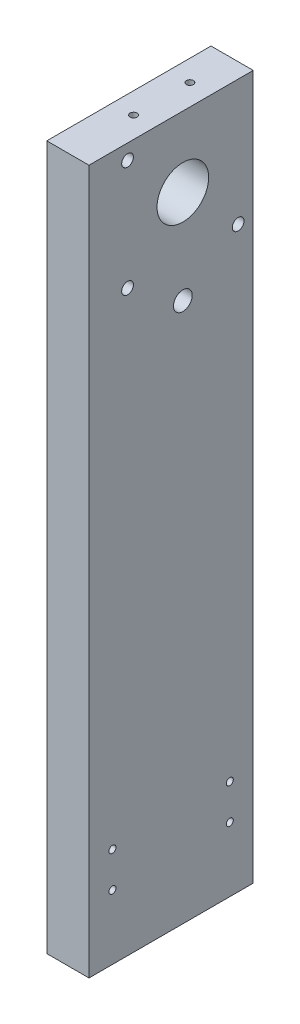
ISO-10303-21;
HEADER;
FILE_DESCRIPTION(('STEP AP214'),'2;1');
FILE_NAME('part.step','',(''),(''),'','','');
FILE_SCHEMA(('AUTOMOTIVE_DESIGN { 1 0 10303 214 1 1 1 1 }'));
ENDSEC;
DATA;
#1=APPLICATION_CONTEXT('core data for automotive mechanical design processes');
#2=APPLICATION_PROTOCOL_DEFINITION('international standard','automotive_design',2000,#1);
#3=PRODUCT_CONTEXT('',#1,'mechanical');
#4=PRODUCT('Part','Part','',(#3));
#5=PRODUCT_RELATED_PRODUCT_CATEGORY('part','',(#4));
#6=PRODUCT_DEFINITION_FORMATION('','',#4);
#7=PRODUCT_DEFINITION_CONTEXT('part definition',#1,'design');
#8=PRODUCT_DEFINITION('design','',#6,#7);
#9=PRODUCT_DEFINITION_SHAPE('','',#8);
#10=(LENGTH_UNIT() NAMED_UNIT(*) SI_UNIT(.MILLI.,.METRE.));
#11=(NAMED_UNIT(*) PLANE_ANGLE_UNIT() SI_UNIT($,.RADIAN.));
#12=(NAMED_UNIT(*) SI_UNIT($,.STERADIAN.) SOLID_ANGLE_UNIT());
#13=UNCERTAINTY_MEASURE_WITH_UNIT(LENGTH_MEASURE(1.E-05),#10,'distance_accuracy_value','');
#14=(GEOMETRIC_REPRESENTATION_CONTEXT(3) GLOBAL_UNCERTAINTY_ASSIGNED_CONTEXT((#13)) GLOBAL_UNIT_ASSIGNED_CONTEXT((#10,
#11,#12)) REPRESENTATION_CONTEXT('',''));
#15=CARTESIAN_POINT('',(0.,0.,0.));
#16=DIRECTION('',(0.,0.,1.));
#17=DIRECTION('',(1.,0.,0.));
#18=AXIS2_PLACEMENT_3D('',#15,#16,#17);
#19=CARTESIAN_POINT('',(18.,0.,0.));
#20=DIRECTION('',(1.,0.,0.));
#21=DIRECTION('',(0.,0.,-1.));
#22=AXIS2_PLACEMENT_3D('',#19,#20,#21);
#23=PLANE('',#22);
#24=CARTESIAN_POINT('',(18.,96.43,18.57));
#25=DIRECTION('',(1.,0.,0.));
#26=DIRECTION('',(0.,0.,-1.));
#27=AXIS2_PLACEMENT_3D('',#24,#25,#26);
#28=CIRCLE('',#27,2.5);
#29=CARTESIAN_POINT('',(18.,96.43,16.07));
#30=VERTEX_POINT('',#29);
#31=EDGE_CURVE('E150',#30,#30,#28,.T.);
#32=ORIENTED_EDGE('',*,*,#31,.F.);
#33=EDGE_LOOP('',(#32));
#34=FACE_BOUND('',#33,.T.);
#35=CARTESIAN_POINT('',(18.,96.43,-28.57));
#36=DIRECTION('',(1.,0.,0.));
#37=DIRECTION('',(0.,0.,-1.));
#38=AXIS2_PLACEMENT_3D('',#35,#36,#37);
#39=CIRCLE('',#38,2.5);
#40=CARTESIAN_POINT('',(18.,96.43,-31.07));
#41=VERTEX_POINT('',#40);
#42=EDGE_CURVE('E138',#41,#41,#39,.T.);
#43=ORIENTED_EDGE('',*,*,#42,.F.);
#44=EDGE_LOOP('',(#43));
#45=FACE_BOUND('',#44,.T.);
#46=CARTESIAN_POINT('',(18.,-107.5,25.));
#47=DIRECTION('',(1.,0.,0.));
#48=DIRECTION('',(0.,0.,-1.));
#49=AXIS2_PLACEMENT_3D('',#46,#47,#48);
#50=CIRCLE('',#49,1.5);
#51=CARTESIAN_POINT('',(18.,-107.5,23.5));
#52=VERTEX_POINT('',#51);
#53=EDGE_CURVE('E126',#52,#52,#50,.T.);
#54=ORIENTED_EDGE('',*,*,#53,.F.);
#55=EDGE_LOOP('',(#54));
#56=FACE_BOUND('',#55,.T.);
#57=CARTESIAN_POINT('',(18.,-122.5,25.));
#58=DIRECTION('',(1.,0.,0.));
#59=DIRECTION('',(0.,0.,-1.));
#60=AXIS2_PLACEMENT_3D('',#57,#58,#59);
#61=CIRCLE('',#60,1.5);
#62=CARTESIAN_POINT('',(18.,-122.5,23.5));
#63=VERTEX_POINT('',#62);
#64=EDGE_CURVE('E114',#63,#63,#61,.T.);
#65=ORIENTED_EDGE('',*,*,#64,.F.);
#66=EDGE_LOOP('',(#65));
#67=FACE_BOUND('',#66,.T.);
#68=DIRECTION('',(0.,1.,0.));
#69=VECTOR('',#68,1.);
#70=CARTESIAN_POINT('',(18.,-150.,-35.));
#71=LINE('',#70,#69);
#72=CARTESIAN_POINT('',(18.,-150.,-35.));
#73=VERTEX_POINT('',#72);
#74=CARTESIAN_POINT('',(18.,150.,-35.));
#75=VERTEX_POINT('',#74);
#76=EDGE_CURVE('E84',#73,#75,#71,.T.);
#77=ORIENTED_EDGE('',*,*,#76,.T.);
#78=DIRECTION('',(0.,0.,1.));
#79=VECTOR('',#78,1.);
#80=CARTESIAN_POINT('',(18.,150.,-35.));
#81=LINE('',#80,#79);
#82=CARTESIAN_POINT('',(18.,150.,35.));
#83=VERTEX_POINT('',#82);
#84=EDGE_CURVE('E79',#75,#83,#81,.T.);
#85=ORIENTED_EDGE('',*,*,#84,.T.);
#86=DIRECTION('',(0.,-1.,0.));
#87=VECTOR('',#86,1.);
#88=CARTESIAN_POINT('',(18.,-150.,35.));
#89=LINE('',#88,#87);
#90=CARTESIAN_POINT('',(18.,-150.,35.));
#91=VERTEX_POINT('',#90);
#92=EDGE_CURVE('E82',#83,#91,#89,.T.);
#93=ORIENTED_EDGE('',*,*,#92,.T.);
#94=DIRECTION('',(0.,0.,-1.));
#95=VECTOR('',#94,1.);
#96=CARTESIAN_POINT('',(18.,-150.,-35.));
#97=LINE('',#96,#95);
#98=EDGE_CURVE('E49',#91,#73,#97,.T.);
#99=ORIENTED_EDGE('',*,*,#98,.T.);
#100=EDGE_LOOP('',(#77,#85,#93,#99));
#101=FACE_BOUND('',#100,.T.);
#102=CARTESIAN_POINT('',(18.,-122.5,-25.));
#103=DIRECTION('',(1.,0.,0.));
#104=DIRECTION('',(0.,0.,-1.));
#105=AXIS2_PLACEMENT_3D('',#102,#103,#104);
#106=CIRCLE('',#105,1.5);
#107=CARTESIAN_POINT('',(18.,-122.5,-26.5));
#108=VERTEX_POINT('',#107);
#109=EDGE_CURVE('E99',#108,#108,#106,.T.);
#110=ORIENTED_EDGE('',*,*,#109,.F.);
#111=EDGE_LOOP('',(#110));
#112=FACE_BOUND('',#111,.T.);
#113=CARTESIAN_POINT('',(18.,-107.5,-25.));
#114=DIRECTION('',(1.,0.,0.));
#115=DIRECTION('',(0.,0.,-1.));
#116=AXIS2_PLACEMENT_3D('',#113,#114,#115);
#117=CIRCLE('',#116,1.5);
#118=CARTESIAN_POINT('',(18.,-107.5,-26.5));
#119=VERTEX_POINT('',#118);
#120=EDGE_CURVE('E120',#119,#119,#117,.T.);
#121=ORIENTED_EDGE('',*,*,#120,.F.);
#122=EDGE_LOOP('',(#121));
#123=FACE_BOUND('',#122,.T.);
#124=CARTESIAN_POINT('',(18.,80.,-5.));
#125=DIRECTION('',(1.,0.,0.));
#126=DIRECTION('',(0.,0.,-1.));
#127=AXIS2_PLACEMENT_3D('',#124,#125,#126);
#128=CIRCLE('',#127,4.);
#129=CARTESIAN_POINT('',(18.,80.,-9.00000000000001));
#130=VERTEX_POINT('',#129);
#131=EDGE_CURVE('E132',#130,#130,#128,.T.);
#132=ORIENTED_EDGE('',*,*,#131,.F.);
#133=EDGE_LOOP('',(#132));
#134=FACE_BOUND('',#133,.T.);
#135=CARTESIAN_POINT('',(18.,120.,-5.));
#136=DIRECTION('',(1.,0.,0.));
#137=DIRECTION('',(0.,0.,-1.));
#138=AXIS2_PLACEMENT_3D('',#135,#136,#137);
#139=CIRCLE('',#138,11.);
#140=CARTESIAN_POINT('',(18.,120.,-16.));
#141=VERTEX_POINT('',#140);
#142=EDGE_CURVE('E144',#141,#141,#139,.T.);
#143=ORIENTED_EDGE('',*,*,#142,.F.);
#144=EDGE_LOOP('',(#143));
#145=FACE_BOUND('',#144,.T.);
#146=CARTESIAN_POINT('',(18.,143.57,18.57));
#147=DIRECTION('',(1.,0.,0.));
#148=DIRECTION('',(0.,0.,-1.));
#149=AXIS2_PLACEMENT_3D('',#146,#147,#148);
#150=CIRCLE('',#149,2.5);
#151=CARTESIAN_POINT('',(18.,143.57,16.07));
#152=VERTEX_POINT('',#151);
#153=EDGE_CURVE('E156',#152,#152,#150,.T.);
#154=ORIENTED_EDGE('',*,*,#153,.F.);
#155=EDGE_LOOP('',(#154));
#156=FACE_BOUND('',#155,.T.);
#157=ADVANCED_FACE('F32',(#34,#45,#56,#67,#101,#112,#123,#134,#145,#156),#23,.T.);
#158=CARTESIAN_POINT('',(0.,0.,0.));
#159=DIRECTION('',(1.,0.,0.));
#160=DIRECTION('',(0.,0.,-1.));
#161=AXIS2_PLACEMENT_3D('',#158,#159,#160);
#162=PLANE('',#161);
#163=DIRECTION('',(0.,1.,0.));
#164=VECTOR('',#163,1.);
#165=CARTESIAN_POINT('',(0.,-150.,-35.));
#166=LINE('',#165,#164);
#167=CARTESIAN_POINT('',(0.,-150.,-35.));
#168=VERTEX_POINT('',#167);
#169=CARTESIAN_POINT('',(0.,150.,-35.));
#170=VERTEX_POINT('',#169);
#171=EDGE_CURVE('E96',#168,#170,#166,.T.);
#172=ORIENTED_EDGE('',*,*,#171,.F.);
#173=DIRECTION('',(0.,0.,-1.));
#174=VECTOR('',#173,1.);
#175=CARTESIAN_POINT('',(0.,-150.,-35.));
#176=LINE('',#175,#174);
#177=CARTESIAN_POINT('',(0.,-150.,35.));
#178=VERTEX_POINT('',#177);
#179=EDGE_CURVE('E72',#178,#168,#176,.T.);
#180=ORIENTED_EDGE('',*,*,#179,.F.);
#181=DIRECTION('',(0.,-1.,0.));
#182=VECTOR('',#181,1.);
#183=CARTESIAN_POINT('',(0.,-150.,35.));
#184=LINE('',#183,#182);
#185=CARTESIAN_POINT('',(0.,150.,35.));
#186=VERTEX_POINT('',#185);
#187=EDGE_CURVE('E66',#186,#178,#184,.T.);
#188=ORIENTED_EDGE('',*,*,#187,.F.);
#189=DIRECTION('',(0.,0.,1.));
#190=VECTOR('',#189,1.);
#191=CARTESIAN_POINT('',(0.,150.,-35.));
#192=LINE('',#191,#190);
#193=EDGE_CURVE('E88',#170,#186,#192,.T.);
#194=ORIENTED_EDGE('',*,*,#193,.F.);
#195=EDGE_LOOP('',(#172,#180,#188,#194));
#196=FACE_BOUND('',#195,.T.);
#197=CARTESIAN_POINT('',(0.,-122.5,-25.));
#198=DIRECTION('',(1.,0.,0.));
#199=DIRECTION('',(0.,0.,-1.));
#200=AXIS2_PLACEMENT_3D('',#197,#198,#199);
#201=CIRCLE('',#200,1.5);
#202=CARTESIAN_POINT('',(0.,-122.5,-26.5));
#203=VERTEX_POINT('',#202);
#204=EDGE_CURVE('E111',#203,#203,#201,.T.);
#205=ORIENTED_EDGE('',*,*,#204,.T.);
#206=EDGE_LOOP('',(#205));
#207=FACE_BOUND('',#206,.T.);
#208=CARTESIAN_POINT('',(0.,-122.5,25.));
#209=DIRECTION('',(1.,0.,0.));
#210=DIRECTION('',(0.,0.,-1.));
#211=AXIS2_PLACEMENT_3D('',#208,#209,#210);
#212=CIRCLE('',#211,1.5);
#213=CARTESIAN_POINT('',(0.,-122.5,23.5));
#214=VERTEX_POINT('',#213);
#215=EDGE_CURVE('E117',#214,#214,#212,.T.);
#216=ORIENTED_EDGE('',*,*,#215,.T.);
#217=EDGE_LOOP('',(#216));
#218=FACE_BOUND('',#217,.T.);
#219=CARTESIAN_POINT('',(0.,-107.5,-25.));
#220=DIRECTION('',(1.,0.,0.));
#221=DIRECTION('',(0.,0.,-1.));
#222=AXIS2_PLACEMENT_3D('',#219,#220,#221);
#223=CIRCLE('',#222,1.5);
#224=CARTESIAN_POINT('',(0.,-107.5,-26.5));
#225=VERTEX_POINT('',#224);
#226=EDGE_CURVE('E123',#225,#225,#223,.T.);
#227=ORIENTED_EDGE('',*,*,#226,.T.);
#228=EDGE_LOOP('',(#227));
#229=FACE_BOUND('',#228,.T.);
#230=CARTESIAN_POINT('',(0.,-107.5,25.));
#231=DIRECTION('',(1.,0.,0.));
#232=DIRECTION('',(0.,0.,-1.));
#233=AXIS2_PLACEMENT_3D('',#230,#231,#232);
#234=CIRCLE('',#233,1.5);
#235=CARTESIAN_POINT('',(0.,-107.5,23.5));
#236=VERTEX_POINT('',#235);
#237=EDGE_CURVE('E129',#236,#236,#234,.T.);
#238=ORIENTED_EDGE('',*,*,#237,.T.);
#239=EDGE_LOOP('',(#238));
#240=FACE_BOUND('',#239,.T.);
#241=CARTESIAN_POINT('',(0.,80.,-5.));
#242=DIRECTION('',(1.,0.,0.));
#243=DIRECTION('',(0.,0.,-1.));
#244=AXIS2_PLACEMENT_3D('',#241,#242,#243);
#245=CIRCLE('',#244,4.);
#246=CARTESIAN_POINT('',(0.,80.,-9.00000000000001));
#247=VERTEX_POINT('',#246);
#248=EDGE_CURVE('E135',#247,#247,#245,.T.);
#249=ORIENTED_EDGE('',*,*,#248,.T.);
#250=EDGE_LOOP('',(#249));
#251=FACE_BOUND('',#250,.T.);
#252=CARTESIAN_POINT('',(0.,96.43,-28.57));
#253=DIRECTION('',(1.,0.,0.));
#254=DIRECTION('',(0.,0.,-1.));
#255=AXIS2_PLACEMENT_3D('',#252,#253,#254);
#256=CIRCLE('',#255,2.5);
#257=CARTESIAN_POINT('',(0.,96.43,-31.07));
#258=VERTEX_POINT('',#257);
#259=EDGE_CURVE('E141',#258,#258,#256,.T.);
#260=ORIENTED_EDGE('',*,*,#259,.T.);
#261=EDGE_LOOP('',(#260));
#262=FACE_BOUND('',#261,.T.);
#263=CARTESIAN_POINT('',(0.,120.,-5.));
#264=DIRECTION('',(1.,0.,0.));
#265=DIRECTION('',(0.,0.,-1.));
#266=AXIS2_PLACEMENT_3D('',#263,#264,#265);
#267=CIRCLE('',#266,11.);
#268=CARTESIAN_POINT('',(0.,120.,-16.));
#269=VERTEX_POINT('',#268);
#270=EDGE_CURVE('E147',#269,#269,#267,.T.);
#271=ORIENTED_EDGE('',*,*,#270,.T.);
#272=EDGE_LOOP('',(#271));
#273=FACE_BOUND('',#272,.T.);
#274=CARTESIAN_POINT('',(0.,96.43,18.57));
#275=DIRECTION('',(1.,0.,0.));
#276=DIRECTION('',(0.,0.,-1.));
#277=AXIS2_PLACEMENT_3D('',#274,#275,#276);
#278=CIRCLE('',#277,2.5);
#279=CARTESIAN_POINT('',(0.,96.43,16.07));
#280=VERTEX_POINT('',#279);
#281=EDGE_CURVE('E153',#280,#280,#278,.T.);
#282=ORIENTED_EDGE('',*,*,#281,.T.);
#283=EDGE_LOOP('',(#282));
#284=FACE_BOUND('',#283,.T.);
#285=CARTESIAN_POINT('',(0.,143.57,18.57));
#286=DIRECTION('',(1.,0.,0.));
#287=DIRECTION('',(0.,0.,-1.));
#288=AXIS2_PLACEMENT_3D('',#285,#286,#287);
#289=CIRCLE('',#288,2.5);
#290=CARTESIAN_POINT('',(0.,143.57,16.07));
#291=VERTEX_POINT('',#290);
#292=EDGE_CURVE('E159',#291,#291,#289,.T.);
#293=ORIENTED_EDGE('',*,*,#292,.T.);
#294=EDGE_LOOP('',(#293));
#295=FACE_BOUND('',#294,.T.);
#296=ADVANCED_FACE('F107',(#196,#207,#218,#229,#240,#251,#262,#273,#284,#295),#162,.F.);
#297=CARTESIAN_POINT('',(18.,-150.,-35.));
#298=DIRECTION('',(0.,0.,1.));
#299=DIRECTION('',(0.,-1.,0.));
#300=AXIS2_PLACEMENT_3D('',#297,#298,#299);
#301=PLANE('',#300);
#302=ORIENTED_EDGE('',*,*,#171,.T.);
#303=DIRECTION('',(-1.,0.,0.));
#304=VECTOR('',#303,1.);
#305=CARTESIAN_POINT('',(18.,150.,-35.));
#306=LINE('',#305,#304);
#307=EDGE_CURVE('E11',#75,#170,#306,.T.);
#308=ORIENTED_EDGE('',*,*,#307,.F.);
#309=ORIENTED_EDGE('',*,*,#76,.F.);
#310=DIRECTION('',(-1.,0.,0.));
#311=VECTOR('',#310,1.);
#312=CARTESIAN_POINT('',(18.,-150.,-35.));
#313=LINE('',#312,#311);
#314=EDGE_CURVE('E92',#73,#168,#313,.T.);
#315=ORIENTED_EDGE('',*,*,#314,.T.);
#316=EDGE_LOOP('',(#302,#308,#309,#315));
#317=FACE_BOUND('',#316,.T.);
#318=ADVANCED_FACE('F34',(#317),#301,.F.);
#319=CARTESIAN_POINT('',(18.,150.,-35.));
#320=DIRECTION('',(0.,-1.,0.));
#321=DIRECTION('',(0.,0.,-1.));
#322=AXIS2_PLACEMENT_3D('',#319,#320,#321);
#323=PLANE('',#322);
#324=CARTESIAN_POINT('',(9.,150.,6.99999999999998));
#325=DIRECTION('',(0.,1.,0.));
#326=DIRECTION('',(0.,0.,1.));
#327=AXIS2_PLACEMENT_3D('',#324,#325,#326);
#328=CIRCLE('',#327,1.5);
#329=CARTESIAN_POINT('',(9.,150.,8.49999999999998));
#330=VERTEX_POINT('',#329);
#331=EDGE_CURVE('E171',#330,#330,#328,.T.);
#332=ORIENTED_EDGE('',*,*,#331,.F.);
#333=EDGE_LOOP('',(#332));
#334=FACE_BOUND('',#333,.T.);
#335=CARTESIAN_POINT('',(9.,150.,-17.));
#336=DIRECTION('',(0.,1.,0.));
#337=DIRECTION('',(0.,0.,1.));
#338=AXIS2_PLACEMENT_3D('',#335,#336,#337);
#339=CIRCLE('',#338,1.5);
#340=CARTESIAN_POINT('',(9.,150.,-15.5));
#341=VERTEX_POINT('',#340);
#342=EDGE_CURVE('E165',#341,#341,#339,.T.);
#343=ORIENTED_EDGE('',*,*,#342,.F.);
#344=EDGE_LOOP('',(#343));
#345=FACE_BOUND('',#344,.T.);
#346=ORIENTED_EDGE('',*,*,#193,.T.);
#347=DIRECTION('',(-1.,0.,0.));
#348=VECTOR('',#347,1.);
#349=CARTESIAN_POINT('',(18.,150.,35.));
#350=LINE('',#349,#348);
#351=EDGE_CURVE('E41',#83,#186,#350,.T.);
#352=ORIENTED_EDGE('',*,*,#351,.F.);
#353=ORIENTED_EDGE('',*,*,#84,.F.);
#354=ORIENTED_EDGE('',*,*,#307,.T.);
#355=EDGE_LOOP('',(#346,#352,#353,#354));
#356=FACE_BOUND('',#355,.T.);
#357=ADVANCED_FACE('F87',(#334,#345,#356),#323,.F.);
#358=CARTESIAN_POINT('',(18.,-150.,35.));
#359=DIRECTION('',(0.,0.,-1.));
#360=DIRECTION('',(-1.,0.,0.));
#361=AXIS2_PLACEMENT_3D('',#358,#359,#360);
#362=PLANE('',#361);
#363=ORIENTED_EDGE('',*,*,#187,.T.);
#364=DIRECTION('',(-1.,0.,0.));
#365=VECTOR('',#364,1.);
#366=CARTESIAN_POINT('',(18.,-150.,35.));
#367=LINE('',#366,#365);
#368=EDGE_CURVE('E89',#91,#178,#367,.T.);
#369=ORIENTED_EDGE('',*,*,#368,.F.);
#370=ORIENTED_EDGE('',*,*,#92,.F.);
#371=ORIENTED_EDGE('',*,*,#351,.T.);
#372=EDGE_LOOP('',(#363,#369,#370,#371));
#373=FACE_BOUND('',#372,.T.);
#374=ADVANCED_FACE('F90',(#373),#362,.F.);
#375=CARTESIAN_POINT('',(18.,-150.,-35.));
#376=DIRECTION('',(0.,1.,0.));
#377=DIRECTION('',(0.,0.,1.));
#378=AXIS2_PLACEMENT_3D('',#375,#376,#377);
#379=PLANE('',#378);
#380=ORIENTED_EDGE('',*,*,#179,.T.);
#381=ORIENTED_EDGE('',*,*,#314,.F.);
#382=ORIENTED_EDGE('',*,*,#98,.F.);
#383=ORIENTED_EDGE('',*,*,#368,.T.);
#384=EDGE_LOOP('',(#380,#381,#382,#383));
#385=FACE_BOUND('',#384,.T.);
#386=ADVANCED_FACE('F104',(#385),#379,.F.);
#387=CARTESIAN_POINT('',(18.,-122.5,-25.));
#388=DIRECTION('',(-1.,0.,0.));
#389=DIRECTION('',(0.,0.,1.));
#390=AXIS2_PLACEMENT_3D('',#387,#388,#389);
#391=CYLINDRICAL_SURFACE('',#390,1.5);
#392=ORIENTED_EDGE('',*,*,#109,.T.);
#393=EDGE_LOOP('',(#392));
#394=FACE_BOUND('',#393,.T.);
#395=ORIENTED_EDGE('',*,*,#204,.F.);
#396=EDGE_LOOP('',(#395));
#397=FACE_BOUND('',#396,.T.);
#398=ADVANCED_FACE('F215',(#394,#397),#391,.F.);
#399=CARTESIAN_POINT('',(18.,-122.5,25.));
#400=DIRECTION('',(-1.,0.,0.));
#401=DIRECTION('',(0.,0.,1.));
#402=AXIS2_PLACEMENT_3D('',#399,#400,#401);
#403=CYLINDRICAL_SURFACE('',#402,1.5);
#404=ORIENTED_EDGE('',*,*,#64,.T.);
#405=EDGE_LOOP('',(#404));
#406=FACE_BOUND('',#405,.T.);
#407=ORIENTED_EDGE('',*,*,#215,.F.);
#408=EDGE_LOOP('',(#407));
#409=FACE_BOUND('',#408,.T.);
#410=ADVANCED_FACE('F237',(#406,#409),#403,.F.);
#411=CARTESIAN_POINT('',(18.,-107.5,-25.));
#412=DIRECTION('',(-1.,0.,0.));
#413=DIRECTION('',(0.,0.,1.));
#414=AXIS2_PLACEMENT_3D('',#411,#412,#413);
#415=CYLINDRICAL_SURFACE('',#414,1.5);
#416=ORIENTED_EDGE('',*,*,#120,.T.);
#417=EDGE_LOOP('',(#416));
#418=FACE_BOUND('',#417,.T.);
#419=ORIENTED_EDGE('',*,*,#226,.F.);
#420=EDGE_LOOP('',(#419));
#421=FACE_BOUND('',#420,.T.);
#422=ADVANCED_FACE('F244',(#418,#421),#415,.F.);
#423=CARTESIAN_POINT('',(18.,-107.5,25.));
#424=DIRECTION('',(-1.,0.,0.));
#425=DIRECTION('',(0.,0.,1.));
#426=AXIS2_PLACEMENT_3D('',#423,#424,#425);
#427=CYLINDRICAL_SURFACE('',#426,1.5);
#428=ORIENTED_EDGE('',*,*,#53,.T.);
#429=EDGE_LOOP('',(#428));
#430=FACE_BOUND('',#429,.T.);
#431=ORIENTED_EDGE('',*,*,#237,.F.);
#432=EDGE_LOOP('',(#431));
#433=FACE_BOUND('',#432,.T.);
#434=ADVANCED_FACE('F251',(#430,#433),#427,.F.);
#435=CARTESIAN_POINT('',(18.,80.,-5.));
#436=DIRECTION('',(-1.,0.,0.));
#437=DIRECTION('',(0.,0.,1.));
#438=AXIS2_PLACEMENT_3D('',#435,#436,#437);
#439=CYLINDRICAL_SURFACE('',#438,4.);
#440=ORIENTED_EDGE('',*,*,#131,.T.);
#441=EDGE_LOOP('',(#440));
#442=FACE_BOUND('',#441,.T.);
#443=ORIENTED_EDGE('',*,*,#248,.F.);
#444=EDGE_LOOP('',(#443));
#445=FACE_BOUND('',#444,.T.);
#446=ADVANCED_FACE('F259',(#442,#445),#439,.F.);
#447=CARTESIAN_POINT('',(18.,96.43,-28.57));
#448=DIRECTION('',(-1.,0.,0.));
#449=DIRECTION('',(0.,0.,1.));
#450=AXIS2_PLACEMENT_3D('',#447,#448,#449);
#451=CYLINDRICAL_SURFACE('',#450,2.5);
#452=ORIENTED_EDGE('',*,*,#42,.T.);
#453=EDGE_LOOP('',(#452));
#454=FACE_BOUND('',#453,.T.);
#455=ORIENTED_EDGE('',*,*,#259,.F.);
#456=EDGE_LOOP('',(#455));
#457=FACE_BOUND('',#456,.T.);
#458=ADVANCED_FACE('F267',(#454,#457),#451,.F.);
#459=CARTESIAN_POINT('',(18.,120.,-5.));
#460=DIRECTION('',(-1.,0.,0.));
#461=DIRECTION('',(0.,0.,1.));
#462=AXIS2_PLACEMENT_3D('',#459,#460,#461);
#463=CYLINDRICAL_SURFACE('',#462,11.);
#464=ORIENTED_EDGE('',*,*,#142,.T.);
#465=EDGE_LOOP('',(#464));
#466=FACE_BOUND('',#465,.T.);
#467=ORIENTED_EDGE('',*,*,#270,.F.);
#468=EDGE_LOOP('',(#467));
#469=FACE_BOUND('',#468,.T.);
#470=ADVANCED_FACE('F275',(#466,#469),#463,.F.);
#471=CARTESIAN_POINT('',(18.,96.43,18.57));
#472=DIRECTION('',(-1.,0.,0.));
#473=DIRECTION('',(0.,0.,1.));
#474=AXIS2_PLACEMENT_3D('',#471,#472,#473);
#475=CYLINDRICAL_SURFACE('',#474,2.5);
#476=ORIENTED_EDGE('',*,*,#31,.T.);
#477=EDGE_LOOP('',(#476));
#478=FACE_BOUND('',#477,.T.);
#479=ORIENTED_EDGE('',*,*,#281,.F.);
#480=EDGE_LOOP('',(#479));
#481=FACE_BOUND('',#480,.T.);
#482=ADVANCED_FACE('F201',(#478,#481),#475,.F.);
#483=CARTESIAN_POINT('',(18.,143.57,18.57));
#484=DIRECTION('',(-1.,0.,0.));
#485=DIRECTION('',(0.,0.,1.));
#486=AXIS2_PLACEMENT_3D('',#483,#484,#485);
#487=CYLINDRICAL_SURFACE('',#486,2.5);
#488=ORIENTED_EDGE('',*,*,#153,.T.);
#489=EDGE_LOOP('',(#488));
#490=FACE_BOUND('',#489,.T.);
#491=ORIENTED_EDGE('',*,*,#292,.F.);
#492=EDGE_LOOP('',(#491));
#493=FACE_BOUND('',#492,.T.);
#494=ADVANCED_FACE('F192',(#490,#493),#487,.F.);
#495=CARTESIAN_POINT('',(9.,136.,-17.));
#496=DIRECTION('',(0.,1.,0.));
#497=DIRECTION('',(0.,0.,1.));
#498=AXIS2_PLACEMENT_3D('',#495,#496,#497);
#499=CYLINDRICAL_SURFACE('',#498,1.5);
#500=CARTESIAN_POINT('',(9.,136.,-17.));
#501=DIRECTION('',(0.,1.,0.));
#502=DIRECTION('',(0.,0.,1.));
#503=AXIS2_PLACEMENT_3D('',#500,#501,#502);
#504=CIRCLE('',#503,1.5);
#505=CARTESIAN_POINT('',(9.,136.,-15.5));
#506=VERTEX_POINT('',#505);
#507=EDGE_CURVE('E168',#506,#506,#504,.T.);
#508=ORIENTED_EDGE('',*,*,#507,.F.);
#509=EDGE_LOOP('',(#508));
#510=FACE_BOUND('',#509,.T.);
#511=ORIENTED_EDGE('',*,*,#342,.T.);
#512=EDGE_LOOP('',(#511));
#513=FACE_BOUND('',#512,.T.);
#514=ADVANCED_FACE('F190',(#510,#513),#499,.F.);
#515=CARTESIAN_POINT('',(9.,136.,-17.));
#516=DIRECTION('',(0.,1.,0.));
#517=DIRECTION('',(0.,0.,1.));
#518=AXIS2_PLACEMENT_3D('',#515,#516,#517);
#519=PLANE('',#518);
#520=ORIENTED_EDGE('',*,*,#507,.T.);
#521=EDGE_LOOP('',(#520));
#522=FACE_BOUND('',#521,.T.);
#523=ADVANCED_FACE('F182',(#522),#519,.T.);
#524=CARTESIAN_POINT('',(9.,136.,6.99999999999999));
#525=DIRECTION('',(0.,1.,0.));
#526=DIRECTION('',(0.,0.,1.));
#527=AXIS2_PLACEMENT_3D('',#524,#525,#526);
#528=CYLINDRICAL_SURFACE('',#527,1.5);
#529=CARTESIAN_POINT('',(9.,136.,6.99999999999999));
#530=DIRECTION('',(0.,1.,0.));
#531=DIRECTION('',(0.,0.,1.));
#532=AXIS2_PLACEMENT_3D('',#529,#530,#531);
#533=CIRCLE('',#532,1.5);
#534=CARTESIAN_POINT('',(9.,136.,8.49999999999999));
#535=VERTEX_POINT('',#534);
#536=EDGE_CURVE('E162',#535,#535,#533,.T.);
#537=ORIENTED_EDGE('',*,*,#536,.F.);
#538=EDGE_LOOP('',(#537));
#539=FACE_BOUND('',#538,.T.);
#540=ORIENTED_EDGE('',*,*,#331,.T.);
#541=EDGE_LOOP('',(#540));
#542=FACE_BOUND('',#541,.T.);
#543=ADVANCED_FACE('F179',(#539,#542),#528,.F.);
#544=CARTESIAN_POINT('',(9.,136.,6.99999999999999));
#545=DIRECTION('',(0.,1.,0.));
#546=DIRECTION('',(0.,0.,1.));
#547=AXIS2_PLACEMENT_3D('',#544,#545,#546);
#548=PLANE('',#547);
#549=ORIENTED_EDGE('',*,*,#536,.T.);
#550=EDGE_LOOP('',(#549));
#551=FACE_BOUND('',#550,.T.);
#552=ADVANCED_FACE('F177',(#551),#548,.T.);
#553=CLOSED_SHELL('',(#157,#296,#318,#357,#374,#386,#398,#410,#422,#434,#446,#458,#470,#482,
#494,#514,#523,#543,#552));
#554=MANIFOLD_SOLID_BREP('B2',#553);
#555=ADVANCED_BREP_SHAPE_REPRESENTATION('',(#18,#554),#14);
#556=SHAPE_DEFINITION_REPRESENTATION(#9,#555);
ENDSEC;
END-ISO-10303-21;
